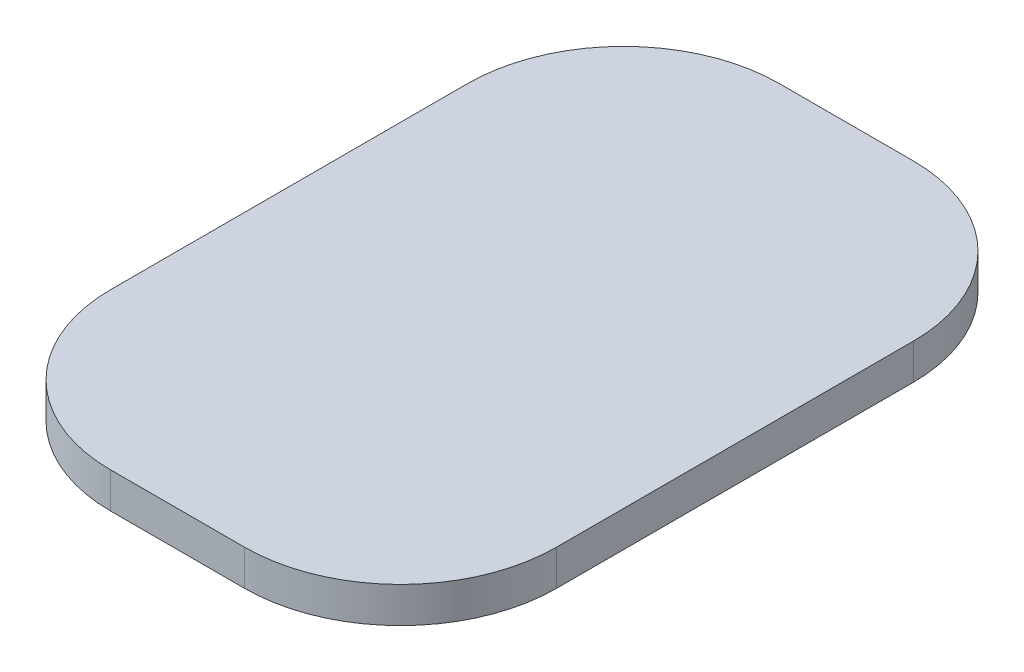
ISO-10303-21;
HEADER;
FILE_DESCRIPTION(('STEP AP214'),'2;1');
FILE_NAME('part.step','',(''),(''),'','','');
FILE_SCHEMA(('AUTOMOTIVE_DESIGN { 1 0 10303 214 1 1 1 1 }'));
ENDSEC;
DATA;
#1=APPLICATION_CONTEXT('core data for automotive mechanical design processes');
#2=APPLICATION_PROTOCOL_DEFINITION('international standard','automotive_design',2000,#1);
#3=PRODUCT_CONTEXT('',#1,'mechanical');
#4=PRODUCT('Part','Part','',(#3));
#5=PRODUCT_RELATED_PRODUCT_CATEGORY('part','',(#4));
#6=PRODUCT_DEFINITION_FORMATION('','',#4);
#7=PRODUCT_DEFINITION_CONTEXT('part definition',#1,'design');
#8=PRODUCT_DEFINITION('design','',#6,#7);
#9=PRODUCT_DEFINITION_SHAPE('','',#8);
#10=(LENGTH_UNIT() NAMED_UNIT(*) SI_UNIT(.MILLI.,.METRE.));
#11=(NAMED_UNIT(*) PLANE_ANGLE_UNIT() SI_UNIT($,.RADIAN.));
#12=(NAMED_UNIT(*) SI_UNIT($,.STERADIAN.) SOLID_ANGLE_UNIT());
#13=UNCERTAINTY_MEASURE_WITH_UNIT(LENGTH_MEASURE(1.E-05),#10,'distance_accuracy_value','');
#14=(GEOMETRIC_REPRESENTATION_CONTEXT(3) GLOBAL_UNCERTAINTY_ASSIGNED_CONTEXT((#13)) GLOBAL_UNIT_ASSIGNED_CONTEXT((#10,
#11,#12)) REPRESENTATION_CONTEXT('',''));
#15=CARTESIAN_POINT('',(0.,0.,0.));
#16=DIRECTION('',(0.,0.,1.));
#17=DIRECTION('',(1.,0.,0.));
#18=AXIS2_PLACEMENT_3D('',#15,#16,#17);
#19=CARTESIAN_POINT('',(-78.3382789317507,8.,-69.6587537091988));
#20=DIRECTION('',(1.,0.,0.));
#21=DIRECTION('',(0.,0.,-1.));
#22=AXIS2_PLACEMENT_3D('',#19,#20,#21);
#23=PLANE('',#22);
#24=DIRECTION('',(0.,0.,1.));
#25=VECTOR('',#24,1.);
#26=CARTESIAN_POINT('',(-78.3382789317507,8.,-69.6587537091988));
#27=LINE('',#26,#25);
#28=CARTESIAN_POINT('',(-78.3382789317507,8.,-34.6587537091988));
#29=VERTEX_POINT('',#28);
#30=CARTESIAN_POINT('',(-78.3382789317507,8.,45.3412462908012));
#31=VERTEX_POINT('',#30);
#32=EDGE_CURVE('E119',#29,#31,#27,.T.);
#33=ORIENTED_EDGE('',*,*,#32,.F.);
#34=DIRECTION('',(0.,-1.,0.));
#35=VECTOR('',#34,1.);
#36=CARTESIAN_POINT('',(-78.3382789317507,8.,-34.6587537091988));
#37=LINE('',#36,#35);
#38=CARTESIAN_POINT('',(-78.3382789317507,0.,-34.6587537091988));
#39=VERTEX_POINT('',#38);
#40=EDGE_CURVE('E104',#29,#39,#37,.T.);
#41=ORIENTED_EDGE('',*,*,#40,.T.);
#42=DIRECTION('',(0.,0.,1.));
#43=VECTOR('',#42,1.);
#44=CARTESIAN_POINT('',(-78.3382789317507,0.,-69.6587537091988));
#45=LINE('',#44,#43);
#46=CARTESIAN_POINT('',(-78.3382789317507,0.,45.3412462908012));
#47=VERTEX_POINT('',#46);
#48=EDGE_CURVE('E116',#39,#47,#45,.T.);
#49=ORIENTED_EDGE('',*,*,#48,.T.);
#50=DIRECTION('',(0.,-1.,0.));
#51=VECTOR('',#50,1.);
#52=CARTESIAN_POINT('',(-78.3382789317507,8.,45.3412462908012));
#53=LINE('',#52,#51);
#54=EDGE_CURVE('E121',#47,#31,#53,.F.);
#55=ORIENTED_EDGE('',*,*,#54,.T.);
#56=EDGE_LOOP('',(#33,#41,#49,#55));
#57=FACE_BOUND('',#56,.T.);
#58=ADVANCED_FACE('F33',(#57),#23,.F.);
#59=CARTESIAN_POINT('',(-78.3382789317507,8.,80.3412462908012));
#60=DIRECTION('',(0.,0.,-1.));
#61=DIRECTION('',(-1.,0.,0.));
#62=AXIS2_PLACEMENT_3D('',#59,#60,#61);
#63=PLANE('',#62);
#64=DIRECTION('',(1.,0.,0.));
#65=VECTOR('',#64,1.);
#66=CARTESIAN_POINT('',(-78.3382789317507,8.,80.3412462908012));
#67=LINE('',#66,#65);
#68=CARTESIAN_POINT('',(-43.3382789317507,8.,80.3412462908012));
#69=VERTEX_POINT('',#68);
#70=CARTESIAN_POINT('',(-13.3382789317507,8.,80.3412462908012));
#71=VERTEX_POINT('',#70);
#72=EDGE_CURVE('E159',#69,#71,#67,.T.);
#73=ORIENTED_EDGE('',*,*,#72,.F.);
#74=DIRECTION('',(0.,-1.,0.));
#75=VECTOR('',#74,1.);
#76=CARTESIAN_POINT('',(-43.3382789317507,8.,80.3412462908012));
#77=LINE('',#76,#75);
#78=CARTESIAN_POINT('',(-43.3382789317507,0.,80.3412462908012));
#79=VERTEX_POINT('',#78);
#80=EDGE_CURVE('E11',#69,#79,#77,.T.);
#81=ORIENTED_EDGE('',*,*,#80,.T.);
#82=DIRECTION('',(1.,0.,0.));
#83=VECTOR('',#82,1.);
#84=CARTESIAN_POINT('',(-78.3382789317507,0.,80.3412462908012));
#85=LINE('',#84,#83);
#86=CARTESIAN_POINT('',(-13.3382789317507,0.,80.3412462908012));
#87=VERTEX_POINT('',#86);
#88=EDGE_CURVE('E126',#79,#87,#85,.T.);
#89=ORIENTED_EDGE('',*,*,#88,.T.);
#90=DIRECTION('',(0.,-1.,0.));
#91=VECTOR('',#90,1.);
#92=CARTESIAN_POINT('',(-13.3382789317507,8.,80.3412462908012));
#93=LINE('',#92,#91);
#94=EDGE_CURVE('E41',#87,#71,#93,.F.);
#95=ORIENTED_EDGE('',*,*,#94,.T.);
#96=EDGE_LOOP('',(#73,#81,#89,#95));
#97=FACE_BOUND('',#96,.T.);
#98=ADVANCED_FACE('F158',(#97),#63,.F.);
#99=CARTESIAN_POINT('',(21.6617210682493,8.,-69.6587537091988));
#100=DIRECTION('',(-1.,0.,0.));
#101=DIRECTION('',(0.,0.,1.));
#102=AXIS2_PLACEMENT_3D('',#99,#100,#101);
#103=PLANE('',#102);
#104=DIRECTION('',(0.,0.,-1.));
#105=VECTOR('',#104,1.);
#106=CARTESIAN_POINT('',(21.6617210682493,0.,-69.6587537091988));
#107=LINE('',#106,#105);
#108=CARTESIAN_POINT('',(21.6617210682493,0.,45.3412462908012));
#109=VERTEX_POINT('',#108);
#110=CARTESIAN_POINT('',(21.6617210682493,0.,-34.6587537091988));
#111=VERTEX_POINT('',#110);
#112=EDGE_CURVE('E129',#109,#111,#107,.T.);
#113=ORIENTED_EDGE('',*,*,#112,.T.);
#114=DIRECTION('',(0.,-1.,0.));
#115=VECTOR('',#114,1.);
#116=CARTESIAN_POINT('',(21.6617210682493,8.,-34.6587537091988));
#117=LINE('',#116,#115);
#118=CARTESIAN_POINT('',(21.6617210682493,8.,-34.6587537091988));
#119=VERTEX_POINT('',#118);
#120=EDGE_CURVE('E48',#111,#119,#117,.F.);
#121=ORIENTED_EDGE('',*,*,#120,.T.);
#122=DIRECTION('',(0.,0.,-1.));
#123=VECTOR('',#122,1.);
#124=CARTESIAN_POINT('',(21.6617210682493,8.,-69.6587537091988));
#125=LINE('',#124,#123);
#126=CARTESIAN_POINT('',(21.6617210682493,8.,45.3412462908012));
#127=VERTEX_POINT('',#126);
#128=EDGE_CURVE('E165',#127,#119,#125,.T.);
#129=ORIENTED_EDGE('',*,*,#128,.F.);
#130=DIRECTION('',(0.,-1.,0.));
#131=VECTOR('',#130,1.);
#132=CARTESIAN_POINT('',(21.6617210682493,8.,45.3412462908012));
#133=LINE('',#132,#131);
#134=EDGE_CURVE('E152',#127,#109,#133,.T.);
#135=ORIENTED_EDGE('',*,*,#134,.T.);
#136=EDGE_LOOP('',(#113,#121,#129,#135));
#137=FACE_BOUND('',#136,.T.);
#138=ADVANCED_FACE('F169',(#137),#103,.F.);
#139=CARTESIAN_POINT('',(-78.3382789317507,8.,-69.6587537091988));
#140=DIRECTION('',(0.,0.,1.));
#141=DIRECTION('',(1.,0.,0.));
#142=AXIS2_PLACEMENT_3D('',#139,#140,#141);
#143=PLANE('',#142);
#144=DIRECTION('',(-1.,0.,0.));
#145=VECTOR('',#144,1.);
#146=CARTESIAN_POINT('',(-78.3382789317507,0.,-69.6587537091988));
#147=LINE('',#146,#145);
#148=CARTESIAN_POINT('',(-13.3382789317507,0.,-69.6587537091988));
#149=VERTEX_POINT('',#148);
#150=CARTESIAN_POINT('',(-43.3382789317507,0.,-69.6587537091988));
#151=VERTEX_POINT('',#150);
#152=EDGE_CURVE('E136',#149,#151,#147,.T.);
#153=ORIENTED_EDGE('',*,*,#152,.T.);
#154=DIRECTION('',(0.,-1.,0.));
#155=VECTOR('',#154,1.);
#156=CARTESIAN_POINT('',(-43.3382789317507,8.,-69.6587537091988));
#157=LINE('',#156,#155);
#158=CARTESIAN_POINT('',(-43.3382789317507,8.,-69.6587537091988));
#159=VERTEX_POINT('',#158);
#160=EDGE_CURVE('E105',#151,#159,#157,.F.);
#161=ORIENTED_EDGE('',*,*,#160,.T.);
#162=DIRECTION('',(-1.,0.,0.));
#163=VECTOR('',#162,1.);
#164=CARTESIAN_POINT('',(-78.3382789317507,8.,-69.6587537091988));
#165=LINE('',#164,#163);
#166=CARTESIAN_POINT('',(-13.3382789317507,8.,-69.6587537091988));
#167=VERTEX_POINT('',#166);
#168=EDGE_CURVE('E132',#167,#159,#165,.T.);
#169=ORIENTED_EDGE('',*,*,#168,.F.);
#170=DIRECTION('',(0.,-1.,0.));
#171=VECTOR('',#170,1.);
#172=CARTESIAN_POINT('',(-13.3382789317507,8.,-69.6587537091988));
#173=LINE('',#172,#171);
#174=EDGE_CURVE('E110',#167,#149,#173,.T.);
#175=ORIENTED_EDGE('',*,*,#174,.T.);
#176=EDGE_LOOP('',(#153,#161,#169,#175));
#177=FACE_BOUND('',#176,.T.);
#178=ADVANCED_FACE('F176',(#177),#143,.F.);
#179=CARTESIAN_POINT('',(0.,8.,0.));
#180=DIRECTION('',(0.,1.,0.));
#181=DIRECTION('',(0.,0.,1.));
#182=AXIS2_PLACEMENT_3D('',#179,#180,#181);
#183=PLANE('',#182);
#184=ORIENTED_EDGE('',*,*,#168,.T.);
#185=CARTESIAN_POINT('',(-43.3382789317507,8.,-34.6587537091988));
#186=DIRECTION('',(0.,1.,0.));
#187=DIRECTION('',(0.,0.,1.));
#188=AXIS2_PLACEMENT_3D('',#185,#186,#187);
#189=CIRCLE('',#188,35.);
#190=EDGE_CURVE('E150',#159,#29,#189,.T.);
#191=ORIENTED_EDGE('',*,*,#190,.T.);
#192=ORIENTED_EDGE('',*,*,#32,.T.);
#193=CARTESIAN_POINT('',(-43.3382789317507,8.,45.3412462908012));
#194=DIRECTION('',(0.,1.,0.));
#195=DIRECTION('',(0.,0.,1.));
#196=AXIS2_PLACEMENT_3D('',#193,#194,#195);
#197=CIRCLE('',#196,35.);
#198=EDGE_CURVE('E146',#31,#69,#197,.T.);
#199=ORIENTED_EDGE('',*,*,#198,.T.);
#200=ORIENTED_EDGE('',*,*,#72,.T.);
#201=CARTESIAN_POINT('',(-13.3382789317507,8.,45.3412462908012));
#202=DIRECTION('',(0.,1.,0.));
#203=DIRECTION('',(0.,0.,1.));
#204=AXIS2_PLACEMENT_3D('',#201,#202,#203);
#205=CIRCLE('',#204,35.);
#206=EDGE_CURVE('E55',#71,#127,#205,.T.);
#207=ORIENTED_EDGE('',*,*,#206,.T.);
#208=ORIENTED_EDGE('',*,*,#128,.T.);
#209=CARTESIAN_POINT('',(-13.3382789317507,8.,-34.6587537091988));
#210=DIRECTION('',(0.,1.,0.));
#211=DIRECTION('',(0.,0.,1.));
#212=AXIS2_PLACEMENT_3D('',#209,#210,#211);
#213=CIRCLE('',#212,35.);
#214=EDGE_CURVE('E148',#119,#167,#213,.T.);
#215=ORIENTED_EDGE('',*,*,#214,.T.);
#216=EDGE_LOOP('',(#184,#191,#192,#199,#200,#207,#208,#215));
#217=FACE_BOUND('',#216,.T.);
#218=ADVANCED_FACE('F163',(#217),#183,.T.);
#219=CARTESIAN_POINT('',(0.,0.,0.));
#220=DIRECTION('',(0.,1.,0.));
#221=DIRECTION('',(0.,0.,1.));
#222=AXIS2_PLACEMENT_3D('',#219,#220,#221);
#223=PLANE('',#222);
#224=ORIENTED_EDGE('',*,*,#48,.F.);
#225=CARTESIAN_POINT('',(-43.3382789317507,0.,-34.6587537091988));
#226=DIRECTION('',(0.,1.,0.));
#227=DIRECTION('',(0.,0.,1.));
#228=AXIS2_PLACEMENT_3D('',#225,#226,#227);
#229=CIRCLE('',#228,35.);
#230=EDGE_CURVE('E100',#39,#151,#229,.F.);
#231=ORIENTED_EDGE('',*,*,#230,.T.);
#232=ORIENTED_EDGE('',*,*,#152,.F.);
#233=CARTESIAN_POINT('',(-13.3382789317507,0.,-34.6587537091988));
#234=DIRECTION('',(0.,1.,0.));
#235=DIRECTION('',(0.,0.,1.));
#236=AXIS2_PLACEMENT_3D('',#233,#234,#235);
#237=CIRCLE('',#236,35.);
#238=EDGE_CURVE('E111',#149,#111,#237,.F.);
#239=ORIENTED_EDGE('',*,*,#238,.T.);
#240=ORIENTED_EDGE('',*,*,#112,.F.);
#241=CARTESIAN_POINT('',(-13.3382789317507,0.,45.3412462908012));
#242=DIRECTION('',(0.,1.,0.));
#243=DIRECTION('',(0.,0.,1.));
#244=AXIS2_PLACEMENT_3D('',#241,#242,#243);
#245=CIRCLE('',#244,35.);
#246=EDGE_CURVE('E120',#109,#87,#245,.F.);
#247=ORIENTED_EDGE('',*,*,#246,.T.);
#248=ORIENTED_EDGE('',*,*,#88,.F.);
#249=CARTESIAN_POINT('',(-43.3382789317507,0.,45.3412462908012));
#250=DIRECTION('',(0.,1.,0.));
#251=DIRECTION('',(0.,0.,1.));
#252=AXIS2_PLACEMENT_3D('',#249,#250,#251);
#253=CIRCLE('',#252,35.);
#254=EDGE_CURVE('E125',#79,#47,#253,.F.);
#255=ORIENTED_EDGE('',*,*,#254,.T.);
#256=EDGE_LOOP('',(#224,#231,#232,#239,#240,#247,#248,#255));
#257=FACE_BOUND('',#256,.T.);
#258=ADVANCED_FACE('F123',(#257),#223,.F.);
#259=CARTESIAN_POINT('',(-43.3382789317507,8.,-34.6587537091988));
#260=DIRECTION('',(0.,-1.,0.));
#261=DIRECTION('',(0.,0.,-1.));
#262=AXIS2_PLACEMENT_3D('',#259,#260,#261);
#263=CYLINDRICAL_SURFACE('',#262,35.);
#264=ORIENTED_EDGE('',*,*,#190,.F.);
#265=ORIENTED_EDGE('',*,*,#160,.F.);
#266=ORIENTED_EDGE('',*,*,#230,.F.);
#267=ORIENTED_EDGE('',*,*,#40,.F.);
#268=EDGE_LOOP('',(#264,#265,#266,#267));
#269=FACE_BOUND('',#268,.T.);
#270=ADVANCED_FACE('F103',(#269),#263,.T.);
#271=CARTESIAN_POINT('',(-13.3382789317507,8.,-34.6587537091988));
#272=DIRECTION('',(0.,-1.,0.));
#273=DIRECTION('',(0.,0.,-1.));
#274=AXIS2_PLACEMENT_3D('',#271,#272,#273);
#275=CYLINDRICAL_SURFACE('',#274,35.);
#276=ORIENTED_EDGE('',*,*,#214,.F.);
#277=ORIENTED_EDGE('',*,*,#120,.F.);
#278=ORIENTED_EDGE('',*,*,#238,.F.);
#279=ORIENTED_EDGE('',*,*,#174,.F.);
#280=EDGE_LOOP('',(#276,#277,#278,#279));
#281=FACE_BOUND('',#280,.T.);
#282=ADVANCED_FACE('F173',(#281),#275,.T.);
#283=CARTESIAN_POINT('',(-43.3382789317507,8.,45.3412462908012));
#284=DIRECTION('',(0.,-1.,0.));
#285=DIRECTION('',(0.,0.,-1.));
#286=AXIS2_PLACEMENT_3D('',#283,#284,#285);
#287=CYLINDRICAL_SURFACE('',#286,35.);
#288=ORIENTED_EDGE('',*,*,#198,.F.);
#289=ORIENTED_EDGE('',*,*,#54,.F.);
#290=ORIENTED_EDGE('',*,*,#254,.F.);
#291=ORIENTED_EDGE('',*,*,#80,.F.);
#292=EDGE_LOOP('',(#288,#289,#290,#291));
#293=FACE_BOUND('',#292,.T.);
#294=ADVANCED_FACE('F179',(#293),#287,.T.);
#295=CARTESIAN_POINT('',(-13.3382789317507,8.,45.3412462908012));
#296=DIRECTION('',(0.,-1.,0.));
#297=DIRECTION('',(0.,0.,-1.));
#298=AXIS2_PLACEMENT_3D('',#295,#296,#297);
#299=CYLINDRICAL_SURFACE('',#298,35.);
#300=ORIENTED_EDGE('',*,*,#206,.F.);
#301=ORIENTED_EDGE('',*,*,#94,.F.);
#302=ORIENTED_EDGE('',*,*,#246,.F.);
#303=ORIENTED_EDGE('',*,*,#134,.F.);
#304=EDGE_LOOP('',(#300,#301,#302,#303));
#305=FACE_BOUND('',#304,.T.);
#306=ADVANCED_FACE('F35',(#305),#299,.T.);
#307=CLOSED_SHELL('',(#58,#98,#138,#178,#218,#258,#270,#282,#294,#306));
#308=MANIFOLD_SOLID_BREP('B2',#307);
#309=ADVANCED_BREP_SHAPE_REPRESENTATION('',(#18,#308),#14);
#310=SHAPE_DEFINITION_REPRESENTATION(#9,#309);
ENDSEC;
END-ISO-10303-21;
